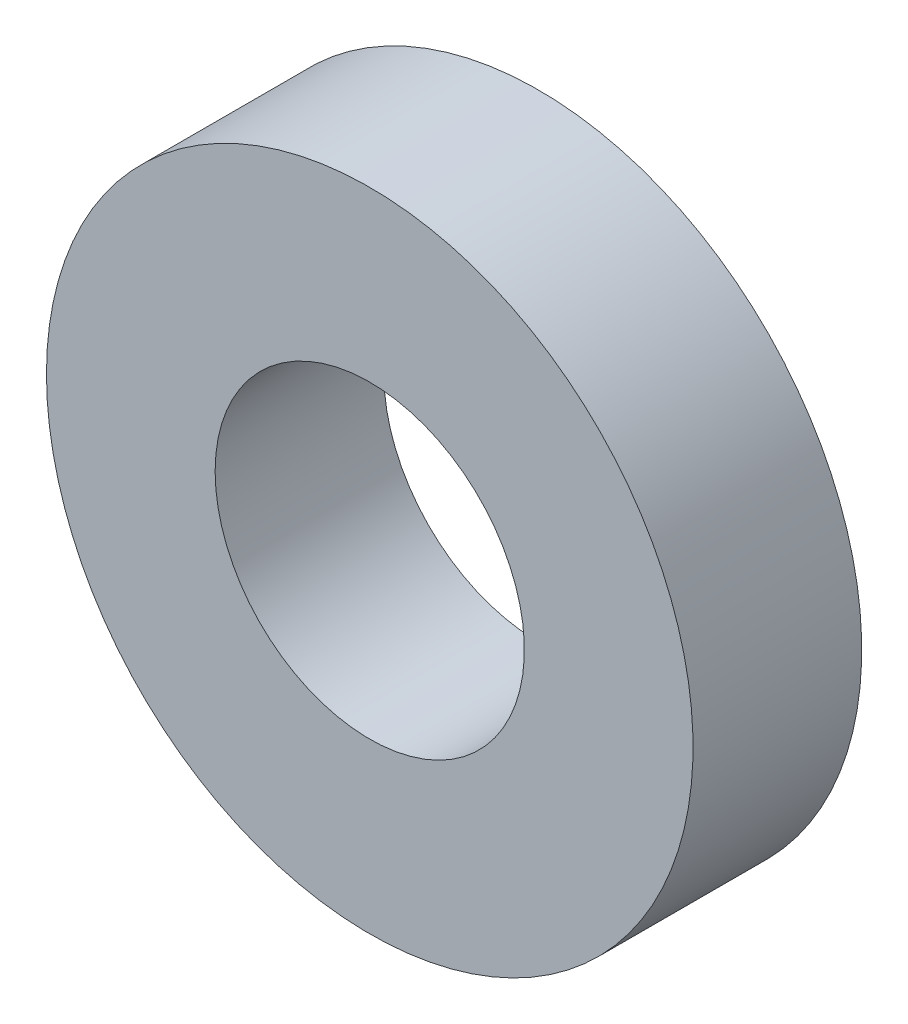
ISO-10303-21;
HEADER;
FILE_DESCRIPTION(('STEP AP214'),'2;1');
FILE_NAME('part.step','',(''),(''),'','','');
FILE_SCHEMA(('AUTOMOTIVE_DESIGN { 1 0 10303 214 1 1 1 1 }'));
ENDSEC;
DATA;
#1=APPLICATION_CONTEXT('core data for automotive mechanical design processes');
#2=APPLICATION_PROTOCOL_DEFINITION('international standard','automotive_design',2000,#1);
#3=PRODUCT_CONTEXT('',#1,'mechanical');
#4=PRODUCT('Part','Part','',(#3));
#5=PRODUCT_RELATED_PRODUCT_CATEGORY('part','',(#4));
#6=PRODUCT_DEFINITION_FORMATION('','',#4);
#7=PRODUCT_DEFINITION_CONTEXT('part definition',#1,'design');
#8=PRODUCT_DEFINITION('design','',#6,#7);
#9=PRODUCT_DEFINITION_SHAPE('','',#8);
#10=(LENGTH_UNIT() NAMED_UNIT(*) SI_UNIT(.MILLI.,.METRE.));
#11=(NAMED_UNIT(*) PLANE_ANGLE_UNIT() SI_UNIT($,.RADIAN.));
#12=(NAMED_UNIT(*) SI_UNIT($,.STERADIAN.) SOLID_ANGLE_UNIT());
#13=UNCERTAINTY_MEASURE_WITH_UNIT(LENGTH_MEASURE(1.E-05),#10,'distance_accuracy_value','');
#14=(GEOMETRIC_REPRESENTATION_CONTEXT(3) GLOBAL_UNCERTAINTY_ASSIGNED_CONTEXT((#13)) GLOBAL_UNIT_ASSIGNED_CONTEXT((#10,
#11,#12)) REPRESENTATION_CONTEXT('',''));
#15=CARTESIAN_POINT('',(0.,0.,0.));
#16=DIRECTION('',(0.,0.,1.));
#17=DIRECTION('',(1.,0.,0.));
#18=AXIS2_PLACEMENT_3D('',#15,#16,#17);
#19=CARTESIAN_POINT('',(0.,0.,19.4818025298864));
#20=DIRECTION('',(0.,0.,-1.));
#21=DIRECTION('',(-1.,0.,0.));
#22=AXIS2_PLACEMENT_3D('',#19,#20,#21);
#23=CYLINDRICAL_SURFACE('',#22,0.6985);
#24=CARTESIAN_POINT('',(0.,0.,19.8628025298864));
#25=DIRECTION('',(0.,0.,-1.));
#26=DIRECTION('',(-1.,0.,0.));
#27=AXIS2_PLACEMENT_3D('',#24,#25,#26);
#28=CIRCLE('',#27,0.6985);
#29=CARTESIAN_POINT('',(-0.6985,0.,19.8628025298864));
#30=VERTEX_POINT('',#29);
#31=EDGE_CURVE('E26',#30,#30,#28,.T.);
#32=ORIENTED_EDGE('',*,*,#31,.F.);
#33=EDGE_LOOP('',(#32));
#34=FACE_BOUND('',#33,.T.);
#35=CARTESIAN_POINT('',(0.,0.,19.1008025298864));
#36=DIRECTION('',(0.,0.,-1.));
#37=DIRECTION('',(-1.,0.,0.));
#38=AXIS2_PLACEMENT_3D('',#35,#36,#37);
#39=CIRCLE('',#38,0.6985);
#40=CARTESIAN_POINT('',(-0.6985,0.,19.1008025298864));
#41=VERTEX_POINT('',#40);
#42=EDGE_CURVE('E17',#41,#41,#39,.F.);
#43=ORIENTED_EDGE('',*,*,#42,.F.);
#44=EDGE_LOOP('',(#43));
#45=FACE_BOUND('',#44,.T.);
#46=ADVANCED_FACE('F14',(#34,#45),#23,.F.);
#47=CARTESIAN_POINT('',(0.,0.6985,19.1008025298864));
#48=DIRECTION('',(0.,0.,-1.));
#49=DIRECTION('',(-1.,0.,0.));
#50=AXIS2_PLACEMENT_3D('',#47,#48,#49);
#51=PLANE('',#50);
#52=ORIENTED_EDGE('',*,*,#42,.T.);
#53=EDGE_LOOP('',(#52));
#54=FACE_BOUND('',#53,.T.);
#55=CARTESIAN_POINT('',(0.,0.,19.1008025298864));
#56=DIRECTION('',(0.,0.,-1.));
#57=DIRECTION('',(-1.,0.,0.));
#58=AXIS2_PLACEMENT_3D('',#55,#56,#57);
#59=CIRCLE('',#58,1.4605);
#60=CARTESIAN_POINT('',(-1.4605,0.,19.1008025298864));
#61=VERTEX_POINT('',#60);
#62=EDGE_CURVE('E21',#61,#61,#59,.F.);
#63=ORIENTED_EDGE('',*,*,#62,.F.);
#64=EDGE_LOOP('',(#63));
#65=FACE_BOUND('',#64,.T.);
#66=ADVANCED_FACE('F34',(#54,#65),#51,.T.);
#67=CARTESIAN_POINT('',(0.,1.4605,19.8628025298864));
#68=DIRECTION('',(0.,0.,1.));
#69=DIRECTION('',(1.,0.,0.));
#70=AXIS2_PLACEMENT_3D('',#67,#68,#69);
#71=PLANE('',#70);
#72=ORIENTED_EDGE('',*,*,#31,.T.);
#73=EDGE_LOOP('',(#72));
#74=FACE_BOUND('',#73,.T.);
#75=CARTESIAN_POINT('',(0.,0.,19.8628025298864));
#76=DIRECTION('',(0.,0.,-1.));
#77=DIRECTION('',(-1.,0.,0.));
#78=AXIS2_PLACEMENT_3D('',#75,#76,#77);
#79=CIRCLE('',#78,1.4605);
#80=CARTESIAN_POINT('',(-1.4605,0.,19.8628025298864));
#81=VERTEX_POINT('',#80);
#82=EDGE_CURVE('E10',#81,#81,#79,.T.);
#83=ORIENTED_EDGE('',*,*,#82,.F.);
#84=EDGE_LOOP('',(#83));
#85=FACE_BOUND('',#84,.T.);
#86=ADVANCED_FACE('F43',(#74,#85),#71,.T.);
#87=CARTESIAN_POINT('',(0.,0.,19.4818025298864));
#88=DIRECTION('',(0.,0.,-1.));
#89=DIRECTION('',(-1.,0.,0.));
#90=AXIS2_PLACEMENT_3D('',#87,#88,#89);
#91=CYLINDRICAL_SURFACE('',#90,1.4605);
#92=ORIENTED_EDGE('',*,*,#82,.T.);
#93=EDGE_LOOP('',(#92));
#94=FACE_BOUND('',#93,.T.);
#95=ORIENTED_EDGE('',*,*,#62,.T.);
#96=EDGE_LOOP('',(#95));
#97=FACE_BOUND('',#96,.T.);
#98=ADVANCED_FACE('F44',(#94,#97),#91,.T.);
#99=CLOSED_SHELL('',(#46,#66,#86,#98));
#100=MANIFOLD_SOLID_BREP('B1',#99);
#101=ADVANCED_BREP_SHAPE_REPRESENTATION('',(#18,#100),#14);
#102=SHAPE_DEFINITION_REPRESENTATION(#9,#101);
ENDSEC;
END-ISO-10303-21;
